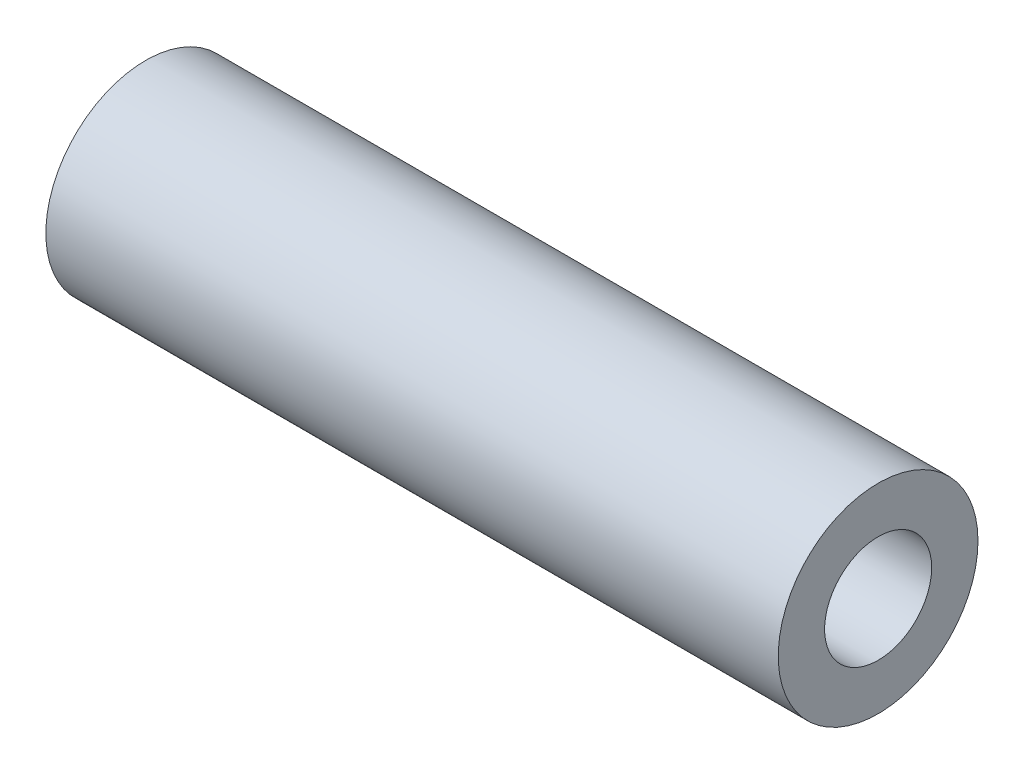
ISO-10303-21;
HEADER;
FILE_DESCRIPTION(('STEP AP214'),'2;1');
FILE_NAME('part.step','',(''),(''),'','','');
FILE_SCHEMA(('AUTOMOTIVE_DESIGN { 1 0 10303 214 1 1 1 1 }'));
ENDSEC;
DATA;
#1=APPLICATION_CONTEXT('core data for automotive mechanical design processes');
#2=APPLICATION_PROTOCOL_DEFINITION('international standard','automotive_design',2000,#1);
#3=PRODUCT_CONTEXT('',#1,'mechanical');
#4=PRODUCT('Part','Part','',(#3));
#5=PRODUCT_RELATED_PRODUCT_CATEGORY('part','',(#4));
#6=PRODUCT_DEFINITION_FORMATION('','',#4);
#7=PRODUCT_DEFINITION_CONTEXT('part definition',#1,'design');
#8=PRODUCT_DEFINITION('design','',#6,#7);
#9=PRODUCT_DEFINITION_SHAPE('','',#8);
#10=(LENGTH_UNIT() NAMED_UNIT(*) SI_UNIT(.MILLI.,.METRE.));
#11=(NAMED_UNIT(*) PLANE_ANGLE_UNIT() SI_UNIT($,.RADIAN.));
#12=(NAMED_UNIT(*) SI_UNIT($,.STERADIAN.) SOLID_ANGLE_UNIT());
#13=UNCERTAINTY_MEASURE_WITH_UNIT(LENGTH_MEASURE(1.E-05),#10,'distance_accuracy_value','');
#14=(GEOMETRIC_REPRESENTATION_CONTEXT(3) GLOBAL_UNCERTAINTY_ASSIGNED_CONTEXT((#13)) GLOBAL_UNIT_ASSIGNED_CONTEXT((#10,
#11,#12)) REPRESENTATION_CONTEXT('',''));
#15=CARTESIAN_POINT('',(0.,0.,0.));
#16=DIRECTION('',(0.,0.,1.));
#17=DIRECTION('',(1.,0.,0.));
#18=AXIS2_PLACEMENT_3D('',#15,#16,#17);
#19=CARTESIAN_POINT('',(34.925,0.,0.));
#20=DIRECTION('',(1.,0.,0.));
#21=DIRECTION('',(0.,0.,-1.));
#22=AXIS2_PLACEMENT_3D('',#19,#20,#21);
#23=PLANE('',#22);
#24=CARTESIAN_POINT('',(34.925,0.,0.));
#25=DIRECTION('',(1.,0.,0.));
#26=DIRECTION('',(0.,0.,-1.));
#27=AXIS2_PLACEMENT_3D('',#24,#25,#26);
#28=CIRCLE('',#27,4.7625);
#29=CARTESIAN_POINT('',(34.925,0.,-4.7625));
#30=VERTEX_POINT('',#29);
#31=EDGE_CURVE('E10',#30,#30,#28,.T.);
#32=ORIENTED_EDGE('',*,*,#31,.T.);
#33=EDGE_LOOP('',(#32));
#34=FACE_BOUND('',#33,.T.);
#35=CARTESIAN_POINT('',(34.925,0.,0.));
#36=DIRECTION('',(1.,0.,0.));
#37=DIRECTION('',(0.,0.,-1.));
#38=AXIS2_PLACEMENT_3D('',#35,#36,#37);
#39=CIRCLE('',#38,2.5527);
#40=CARTESIAN_POINT('',(34.925,0.,-2.5527));
#41=VERTEX_POINT('',#40);
#42=EDGE_CURVE('E41',#41,#41,#39,.T.);
#43=ORIENTED_EDGE('',*,*,#42,.F.);
#44=EDGE_LOOP('',(#43));
#45=FACE_BOUND('',#44,.T.);
#46=ADVANCED_FACE('F30',(#34,#45),#23,.T.);
#47=CARTESIAN_POINT('',(0.,0.,0.));
#48=DIRECTION('',(1.,0.,0.));
#49=DIRECTION('',(0.,0.,-1.));
#50=AXIS2_PLACEMENT_3D('',#47,#48,#49);
#51=PLANE('',#50);
#52=CARTESIAN_POINT('',(0.,0.,0.));
#53=DIRECTION('',(1.,0.,0.));
#54=DIRECTION('',(0.,0.,-1.));
#55=AXIS2_PLACEMENT_3D('',#52,#53,#54);
#56=CIRCLE('',#55,4.7625);
#57=CARTESIAN_POINT('',(0.,0.,-4.7625));
#58=VERTEX_POINT('',#57);
#59=EDGE_CURVE('E34',#58,#58,#56,.T.);
#60=ORIENTED_EDGE('',*,*,#59,.F.);
#61=EDGE_LOOP('',(#60));
#62=FACE_BOUND('',#61,.T.);
#63=CARTESIAN_POINT('',(0.,0.,0.));
#64=DIRECTION('',(1.,0.,0.));
#65=DIRECTION('',(0.,0.,-1.));
#66=AXIS2_PLACEMENT_3D('',#63,#64,#65);
#67=CIRCLE('',#66,2.5527);
#68=CARTESIAN_POINT('',(0.,0.,-2.5527));
#69=VERTEX_POINT('',#68);
#70=EDGE_CURVE('E43',#69,#69,#67,.T.);
#71=ORIENTED_EDGE('',*,*,#70,.T.);
#72=EDGE_LOOP('',(#71));
#73=FACE_BOUND('',#72,.T.);
#74=ADVANCED_FACE('F53',(#62,#73),#51,.F.);
#75=CARTESIAN_POINT('',(34.925,0.,0.));
#76=DIRECTION('',(-1.,0.,0.));
#77=DIRECTION('',(0.,0.,1.));
#78=AXIS2_PLACEMENT_3D('',#75,#76,#77);
#79=CYLINDRICAL_SURFACE('',#78,4.7625);
#80=ORIENTED_EDGE('',*,*,#31,.F.);
#81=EDGE_LOOP('',(#80));
#82=FACE_BOUND('',#81,.T.);
#83=ORIENTED_EDGE('',*,*,#59,.T.);
#84=EDGE_LOOP('',(#83));
#85=FACE_BOUND('',#84,.T.);
#86=ADVANCED_FACE('F32',(#82,#85),#79,.T.);
#87=CARTESIAN_POINT('',(34.925,0.,0.));
#88=DIRECTION('',(-1.,0.,0.));
#89=DIRECTION('',(0.,0.,1.));
#90=AXIS2_PLACEMENT_3D('',#87,#88,#89);
#91=CYLINDRICAL_SURFACE('',#90,2.5527);
#92=ORIENTED_EDGE('',*,*,#42,.T.);
#93=EDGE_LOOP('',(#92));
#94=FACE_BOUND('',#93,.T.);
#95=ORIENTED_EDGE('',*,*,#70,.F.);
#96=EDGE_LOOP('',(#95));
#97=FACE_BOUND('',#96,.T.);
#98=ADVANCED_FACE('F49',(#94,#97),#91,.F.);
#99=CLOSED_SHELL('',(#46,#74,#86,#98));
#100=MANIFOLD_SOLID_BREP('B2',#99);
#101=ADVANCED_BREP_SHAPE_REPRESENTATION('',(#18,#100),#14);
#102=SHAPE_DEFINITION_REPRESENTATION(#9,#101);
ENDSEC;
END-ISO-10303-21;
